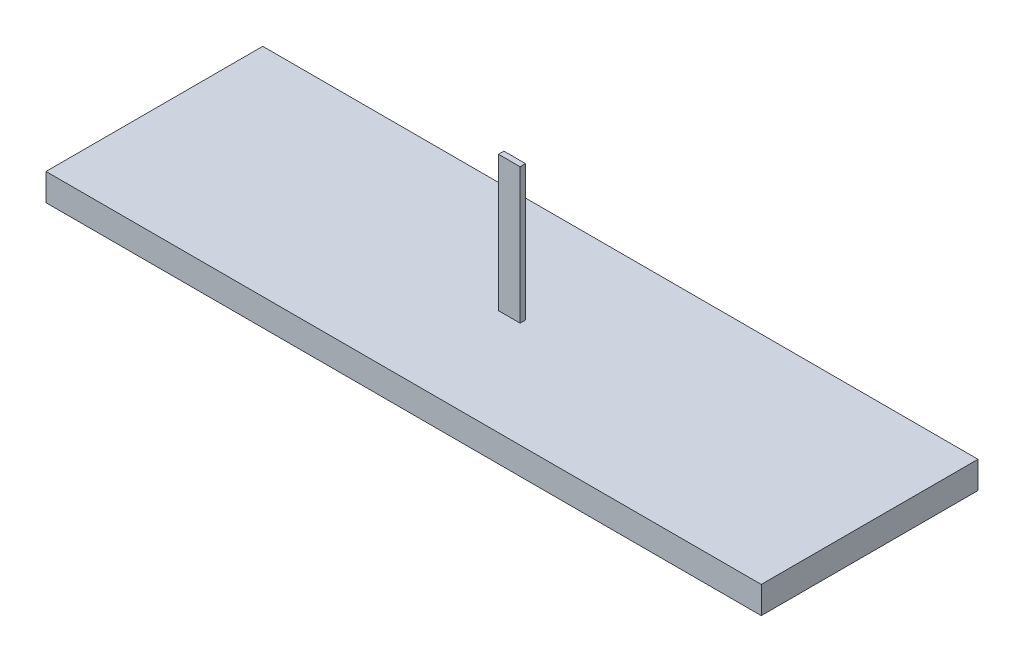
ISO-10303-21;
HEADER;
FILE_DESCRIPTION(('STEP AP214'),'2;1');
FILE_NAME('part.step','',(''),(''),'','','');
FILE_SCHEMA(('AUTOMOTIVE_DESIGN { 1 0 10303 214 1 1 1 1 }'));
ENDSEC;
DATA;
#1=APPLICATION_CONTEXT('core data for automotive mechanical design processes');
#2=APPLICATION_PROTOCOL_DEFINITION('international standard','automotive_design',2000,#1);
#3=PRODUCT_CONTEXT('',#1,'mechanical');
#4=PRODUCT('Part','Part','',(#3));
#5=PRODUCT_RELATED_PRODUCT_CATEGORY('part','',(#4));
#6=PRODUCT_DEFINITION_FORMATION('','',#4);
#7=PRODUCT_DEFINITION_CONTEXT('part definition',#1,'design');
#8=PRODUCT_DEFINITION('design','',#6,#7);
#9=PRODUCT_DEFINITION_SHAPE('','',#8);
#10=(LENGTH_UNIT() NAMED_UNIT(*) SI_UNIT(.MILLI.,.METRE.));
#11=(NAMED_UNIT(*) PLANE_ANGLE_UNIT() SI_UNIT($,.RADIAN.));
#12=(NAMED_UNIT(*) SI_UNIT($,.STERADIAN.) SOLID_ANGLE_UNIT());
#13=UNCERTAINTY_MEASURE_WITH_UNIT(LENGTH_MEASURE(1.E-05),#10,'distance_accuracy_value','');
#14=(GEOMETRIC_REPRESENTATION_CONTEXT(3) GLOBAL_UNCERTAINTY_ASSIGNED_CONTEXT((#13)) GLOBAL_UNIT_ASSIGNED_CONTEXT((#10,
#11,#12)) REPRESENTATION_CONTEXT('',''));
#15=CARTESIAN_POINT('',(0.,0.,0.));
#16=DIRECTION('',(0.,0.,1.));
#17=DIRECTION('',(1.,0.,0.));
#18=AXIS2_PLACEMENT_3D('',#15,#16,#17);
#19=CARTESIAN_POINT('',(0.,5.,0.));
#20=DIRECTION('',(0.,1.,0.));
#21=DIRECTION('',(0.,0.,1.));
#22=AXIS2_PLACEMENT_3D('',#19,#20,#21);
#23=PLANE('',#22);
#24=DIRECTION('',(0.,0.,-1.));
#25=VECTOR('',#24,1.);
#26=CARTESIAN_POINT('',(66.,5.,-20.));
#27=LINE('',#26,#25);
#28=CARTESIAN_POINT('',(66.,5.,20.));
#29=VERTEX_POINT('',#28);
#30=CARTESIAN_POINT('',(66.,5.,-20.));
#31=VERTEX_POINT('',#30);
#32=EDGE_CURVE('E137',#29,#31,#27,.T.);
#33=ORIENTED_EDGE('',*,*,#32,.T.);
#34=DIRECTION('',(-1.,0.,0.));
#35=VECTOR('',#34,1.);
#36=CARTESIAN_POINT('',(-66.,5.,-20.));
#37=LINE('',#36,#35);
#38=CARTESIAN_POINT('',(-66.,5.,-20.));
#39=VERTEX_POINT('',#38);
#40=EDGE_CURVE('E140',#31,#39,#37,.T.);
#41=ORIENTED_EDGE('',*,*,#40,.T.);
#42=DIRECTION('',(0.,0.,1.));
#43=VECTOR('',#42,1.);
#44=CARTESIAN_POINT('',(-66.,5.,-20.));
#45=LINE('',#44,#43);
#46=CARTESIAN_POINT('',(-66.,5.,20.));
#47=VERTEX_POINT('',#46);
#48=EDGE_CURVE('E143',#39,#47,#45,.T.);
#49=ORIENTED_EDGE('',*,*,#48,.T.);
#50=DIRECTION('',(1.,0.,0.));
#51=VECTOR('',#50,1.);
#52=CARTESIAN_POINT('',(-66.,5.,20.));
#53=LINE('',#52,#51);
#54=EDGE_CURVE('E145',#47,#29,#53,.T.);
#55=ORIENTED_EDGE('',*,*,#54,.T.);
#56=EDGE_LOOP('',(#33,#41,#49,#55));
#57=FACE_BOUND('',#56,.T.);
#58=DIRECTION('',(0.,0.,1.));
#59=VECTOR('',#58,1.);
#60=CARTESIAN_POINT('',(-2.,5.,0.));
#61=LINE('',#60,#59);
#62=CARTESIAN_POINT('',(-2.,5.,-0.5));
#63=VERTEX_POINT('',#62);
#64=CARTESIAN_POINT('',(-2.,5.,0.5));
#65=VERTEX_POINT('',#64);
#66=EDGE_CURVE('E55',#63,#65,#61,.T.);
#67=ORIENTED_EDGE('',*,*,#66,.F.);
#68=DIRECTION('',(1.,0.,0.));
#69=VECTOR('',#68,1.);
#70=CARTESIAN_POINT('',(0.,5.,-0.5));
#71=LINE('',#70,#69);
#72=CARTESIAN_POINT('',(2.,5.,-0.5));
#73=VERTEX_POINT('',#72);
#74=EDGE_CURVE('E50',#63,#73,#71,.T.);
#75=ORIENTED_EDGE('',*,*,#74,.T.);
#76=DIRECTION('',(0.,0.,-1.));
#77=VECTOR('',#76,1.);
#78=CARTESIAN_POINT('',(2.,5.,0.));
#79=LINE('',#78,#77);
#80=CARTESIAN_POINT('',(2.,5.,0.5));
#81=VERTEX_POINT('',#80);
#82=EDGE_CURVE('E134',#81,#73,#79,.T.);
#83=ORIENTED_EDGE('',*,*,#82,.F.);
#84=DIRECTION('',(1.,0.,0.));
#85=VECTOR('',#84,1.);
#86=CARTESIAN_POINT('',(0.,5.,0.5));
#87=LINE('',#86,#85);
#88=EDGE_CURVE('E106',#65,#81,#87,.T.);
#89=ORIENTED_EDGE('',*,*,#88,.F.);
#90=EDGE_LOOP('',(#67,#75,#83,#89));
#91=FACE_BOUND('',#90,.T.);
#92=ADVANCED_FACE('F35',(#57,#91),#23,.T.);
#93=CARTESIAN_POINT('',(66.,5.,-20.));
#94=DIRECTION('',(-1.,0.,0.));
#95=DIRECTION('',(0.,0.,1.));
#96=AXIS2_PLACEMENT_3D('',#93,#94,#95);
#97=PLANE('',#96);
#98=DIRECTION('',(0.,0.,-1.));
#99=VECTOR('',#98,1.);
#100=CARTESIAN_POINT('',(66.,0.,-20.));
#101=LINE('',#100,#99);
#102=CARTESIAN_POINT('',(66.,0.,20.));
#103=VERTEX_POINT('',#102);
#104=CARTESIAN_POINT('',(66.,0.,-20.));
#105=VERTEX_POINT('',#104);
#106=EDGE_CURVE('E136',#103,#105,#101,.T.);
#107=ORIENTED_EDGE('',*,*,#106,.T.);
#108=DIRECTION('',(0.,-1.,0.));
#109=VECTOR('',#108,1.);
#110=CARTESIAN_POINT('',(66.,5.,-20.));
#111=LINE('',#110,#109);
#112=EDGE_CURVE('E11',#31,#105,#111,.T.);
#113=ORIENTED_EDGE('',*,*,#112,.F.);
#114=ORIENTED_EDGE('',*,*,#32,.F.);
#115=DIRECTION('',(0.,-1.,0.));
#116=VECTOR('',#115,1.);
#117=CARTESIAN_POINT('',(66.,5.,20.));
#118=LINE('',#117,#116);
#119=EDGE_CURVE('E147',#29,#103,#118,.T.);
#120=ORIENTED_EDGE('',*,*,#119,.T.);
#121=EDGE_LOOP('',(#107,#113,#114,#120));
#122=FACE_BOUND('',#121,.T.);
#123=ADVANCED_FACE('F37',(#122),#97,.F.);
#124=CARTESIAN_POINT('',(-66.,5.,-20.));
#125=DIRECTION('',(0.,0.,1.));
#126=DIRECTION('',(1.,0.,0.));
#127=AXIS2_PLACEMENT_3D('',#124,#125,#126);
#128=PLANE('',#127);
#129=DIRECTION('',(-1.,0.,0.));
#130=VECTOR('',#129,1.);
#131=CARTESIAN_POINT('',(-66.,0.,-20.));
#132=LINE('',#131,#130);
#133=CARTESIAN_POINT('',(-66.,0.,-20.));
#134=VERTEX_POINT('',#133);
#135=EDGE_CURVE('E150',#105,#134,#132,.T.);
#136=ORIENTED_EDGE('',*,*,#135,.T.);
#137=DIRECTION('',(0.,-1.,0.));
#138=VECTOR('',#137,1.);
#139=CARTESIAN_POINT('',(-66.,5.,-20.));
#140=LINE('',#139,#138);
#141=EDGE_CURVE('E43',#39,#134,#140,.T.);
#142=ORIENTED_EDGE('',*,*,#141,.F.);
#143=ORIENTED_EDGE('',*,*,#40,.F.);
#144=ORIENTED_EDGE('',*,*,#112,.T.);
#145=EDGE_LOOP('',(#136,#142,#143,#144));
#146=FACE_BOUND('',#145,.T.);
#147=ADVANCED_FACE('F179',(#146),#128,.F.);
#148=CARTESIAN_POINT('',(-66.,5.,-20.));
#149=DIRECTION('',(1.,0.,0.));
#150=DIRECTION('',(0.,0.,-1.));
#151=AXIS2_PLACEMENT_3D('',#148,#149,#150);
#152=PLANE('',#151);
#153=DIRECTION('',(0.,0.,1.));
#154=VECTOR('',#153,1.);
#155=CARTESIAN_POINT('',(-66.,0.,-20.));
#156=LINE('',#155,#154);
#157=CARTESIAN_POINT('',(-66.,0.,20.));
#158=VERTEX_POINT('',#157);
#159=EDGE_CURVE('E152',#134,#158,#156,.T.);
#160=ORIENTED_EDGE('',*,*,#159,.T.);
#161=DIRECTION('',(0.,-1.,0.));
#162=VECTOR('',#161,1.);
#163=CARTESIAN_POINT('',(-66.,5.,20.));
#164=LINE('',#163,#162);
#165=EDGE_CURVE('E157',#47,#158,#164,.T.);
#166=ORIENTED_EDGE('',*,*,#165,.F.);
#167=ORIENTED_EDGE('',*,*,#48,.F.);
#168=ORIENTED_EDGE('',*,*,#141,.T.);
#169=EDGE_LOOP('',(#160,#166,#167,#168));
#170=FACE_BOUND('',#169,.T.);
#171=ADVANCED_FACE('F164',(#170),#152,.F.);
#172=CARTESIAN_POINT('',(-66.,5.,20.));
#173=DIRECTION('',(0.,0.,-1.));
#174=DIRECTION('',(-1.,0.,0.));
#175=AXIS2_PLACEMENT_3D('',#172,#173,#174);
#176=PLANE('',#175);
#177=DIRECTION('',(1.,0.,0.));
#178=VECTOR('',#177,1.);
#179=CARTESIAN_POINT('',(-66.,0.,20.));
#180=LINE('',#179,#178);
#181=EDGE_CURVE('E141',#158,#103,#180,.T.);
#182=ORIENTED_EDGE('',*,*,#181,.T.);
#183=ORIENTED_EDGE('',*,*,#119,.F.);
#184=ORIENTED_EDGE('',*,*,#54,.F.);
#185=ORIENTED_EDGE('',*,*,#165,.T.);
#186=EDGE_LOOP('',(#182,#183,#184,#185));
#187=FACE_BOUND('',#186,.T.);
#188=ADVANCED_FACE('F173',(#187),#176,.F.);
#189=CARTESIAN_POINT('',(0.,0.,0.));
#190=DIRECTION('',(0.,1.,0.));
#191=DIRECTION('',(0.,0.,1.));
#192=AXIS2_PLACEMENT_3D('',#189,#190,#191);
#193=PLANE('',#192);
#194=ORIENTED_EDGE('',*,*,#106,.F.);
#195=ORIENTED_EDGE('',*,*,#181,.F.);
#196=ORIENTED_EDGE('',*,*,#159,.F.);
#197=ORIENTED_EDGE('',*,*,#135,.F.);
#198=EDGE_LOOP('',(#194,#195,#196,#197));
#199=FACE_BOUND('',#198,.T.);
#200=ADVANCED_FACE('F170',(#199),#193,.F.);
#201=CARTESIAN_POINT('',(2.00000000000001,30.,-0.5));
#202=DIRECTION('',(1.,0.,0.));
#203=DIRECTION('',(0.,1.,0.));
#204=AXIS2_PLACEMENT_3D('',#201,#202,#203);
#205=PLANE('',#204);
#206=DIRECTION('',(0.,1.,0.));
#207=VECTOR('',#206,1.);
#208=CARTESIAN_POINT('',(2.00000000000001,30.,0.5));
#209=LINE('',#208,#207);
#210=CARTESIAN_POINT('',(2.00000000000001,30.,0.5));
#211=VERTEX_POINT('',#210);
#212=EDGE_CURVE('E99',#81,#211,#209,.T.);
#213=ORIENTED_EDGE('',*,*,#212,.F.);
#214=ORIENTED_EDGE('',*,*,#82,.T.);
#215=DIRECTION('',(0.,1.,0.));
#216=VECTOR('',#215,1.);
#217=CARTESIAN_POINT('',(2.00000000000001,30.,-0.5));
#218=LINE('',#217,#216);
#219=CARTESIAN_POINT('',(2.00000000000001,30.,-0.5));
#220=VERTEX_POINT('',#219);
#221=EDGE_CURVE('E113',#73,#220,#218,.T.);
#222=ORIENTED_EDGE('',*,*,#221,.T.);
#223=DIRECTION('',(0.,0.,1.));
#224=VECTOR('',#223,1.);
#225=CARTESIAN_POINT('',(2.00000000000001,30.,-0.5));
#226=LINE('',#225,#224);
#227=EDGE_CURVE('E110',#220,#211,#226,.T.);
#228=ORIENTED_EDGE('',*,*,#227,.T.);
#229=EDGE_LOOP('',(#213,#214,#222,#228));
#230=FACE_BOUND('',#229,.T.);
#231=ADVANCED_FACE('F111',(#230),#205,.T.);
#232=CARTESIAN_POINT('',(-1.99999999999999,30.,-0.5));
#233=DIRECTION('',(-1.,0.,0.));
#234=DIRECTION('',(0.,-1.,0.));
#235=AXIS2_PLACEMENT_3D('',#232,#233,#234);
#236=PLANE('',#235);
#237=DIRECTION('',(0.,-1.,0.));
#238=VECTOR('',#237,1.);
#239=CARTESIAN_POINT('',(-1.99999999999999,30.,-0.5));
#240=LINE('',#239,#238);
#241=CARTESIAN_POINT('',(-1.99999999999999,30.,-0.5));
#242=VERTEX_POINT('',#241);
#243=EDGE_CURVE('E118',#242,#63,#240,.T.);
#244=ORIENTED_EDGE('',*,*,#243,.T.);
#245=ORIENTED_EDGE('',*,*,#66,.T.);
#246=DIRECTION('',(0.,-1.,0.));
#247=VECTOR('',#246,1.);
#248=CARTESIAN_POINT('',(-1.99999999999999,30.,0.5));
#249=LINE('',#248,#247);
#250=CARTESIAN_POINT('',(-1.99999999999999,30.,0.5));
#251=VERTEX_POINT('',#250);
#252=EDGE_CURVE('E121',#251,#65,#249,.T.);
#253=ORIENTED_EDGE('',*,*,#252,.F.);
#254=DIRECTION('',(0.,0.,1.));
#255=VECTOR('',#254,1.);
#256=CARTESIAN_POINT('',(-1.99999999999999,30.,-0.5));
#257=LINE('',#256,#255);
#258=EDGE_CURVE('E117',#242,#251,#257,.T.);
#259=ORIENTED_EDGE('',*,*,#258,.F.);
#260=EDGE_LOOP('',(#244,#245,#253,#259));
#261=FACE_BOUND('',#260,.T.);
#262=ADVANCED_FACE('F210',(#261),#236,.T.);
#263=CARTESIAN_POINT('',(-1.99999999999999,30.,-0.5));
#264=DIRECTION('',(0.,1.,0.));
#265=DIRECTION('',(-1.,0.,0.));
#266=AXIS2_PLACEMENT_3D('',#263,#264,#265);
#267=PLANE('',#266);
#268=ORIENTED_EDGE('',*,*,#258,.T.);
#269=DIRECTION('',(-1.,0.,0.));
#270=VECTOR('',#269,1.);
#271=CARTESIAN_POINT('',(-1.99999999999999,30.,0.5));
#272=LINE('',#271,#270);
#273=EDGE_CURVE('E104',#211,#251,#272,.T.);
#274=ORIENTED_EDGE('',*,*,#273,.F.);
#275=ORIENTED_EDGE('',*,*,#227,.F.);
#276=DIRECTION('',(-1.,0.,0.));
#277=VECTOR('',#276,1.);
#278=CARTESIAN_POINT('',(-1.99999999999999,30.,-0.5));
#279=LINE('',#278,#277);
#280=EDGE_CURVE('E126',#220,#242,#279,.T.);
#281=ORIENTED_EDGE('',*,*,#280,.T.);
#282=EDGE_LOOP('',(#268,#274,#275,#281));
#283=FACE_BOUND('',#282,.T.);
#284=ADVANCED_FACE('F120',(#283),#267,.T.);
#285=CARTESIAN_POINT('',(0.,0.,-0.5));
#286=DIRECTION('',(0.,0.,1.));
#287=DIRECTION('',(1.,0.,0.));
#288=AXIS2_PLACEMENT_3D('',#285,#286,#287);
#289=PLANE('',#288);
#290=ORIENTED_EDGE('',*,*,#74,.F.);
#291=ORIENTED_EDGE('',*,*,#243,.F.);
#292=ORIENTED_EDGE('',*,*,#280,.F.);
#293=ORIENTED_EDGE('',*,*,#221,.F.);
#294=EDGE_LOOP('',(#290,#291,#292,#293));
#295=FACE_BOUND('',#294,.T.);
#296=ADVANCED_FACE('F223',(#295),#289,.F.);
#297=CARTESIAN_POINT('',(0.,0.,0.5));
#298=DIRECTION('',(0.,0.,1.));
#299=DIRECTION('',(1.,0.,0.));
#300=AXIS2_PLACEMENT_3D('',#297,#298,#299);
#301=PLANE('',#300);
#302=ORIENTED_EDGE('',*,*,#252,.T.);
#303=ORIENTED_EDGE('',*,*,#88,.T.);
#304=ORIENTED_EDGE('',*,*,#212,.T.);
#305=ORIENTED_EDGE('',*,*,#273,.T.);
#306=EDGE_LOOP('',(#302,#303,#304,#305));
#307=FACE_BOUND('',#306,.T.);
#308=ADVANCED_FACE('F102',(#307),#301,.T.);
#309=CLOSED_SHELL('',(#92,#123,#147,#171,#188,#200,#231,#262,#284,#296,#308));
#310=MANIFOLD_SOLID_BREP('B2',#309);
#311=ADVANCED_BREP_SHAPE_REPRESENTATION('',(#18,#310),#14);
#312=SHAPE_DEFINITION_REPRESENTATION(#9,#311);
ENDSEC;
END-ISO-10303-21;
